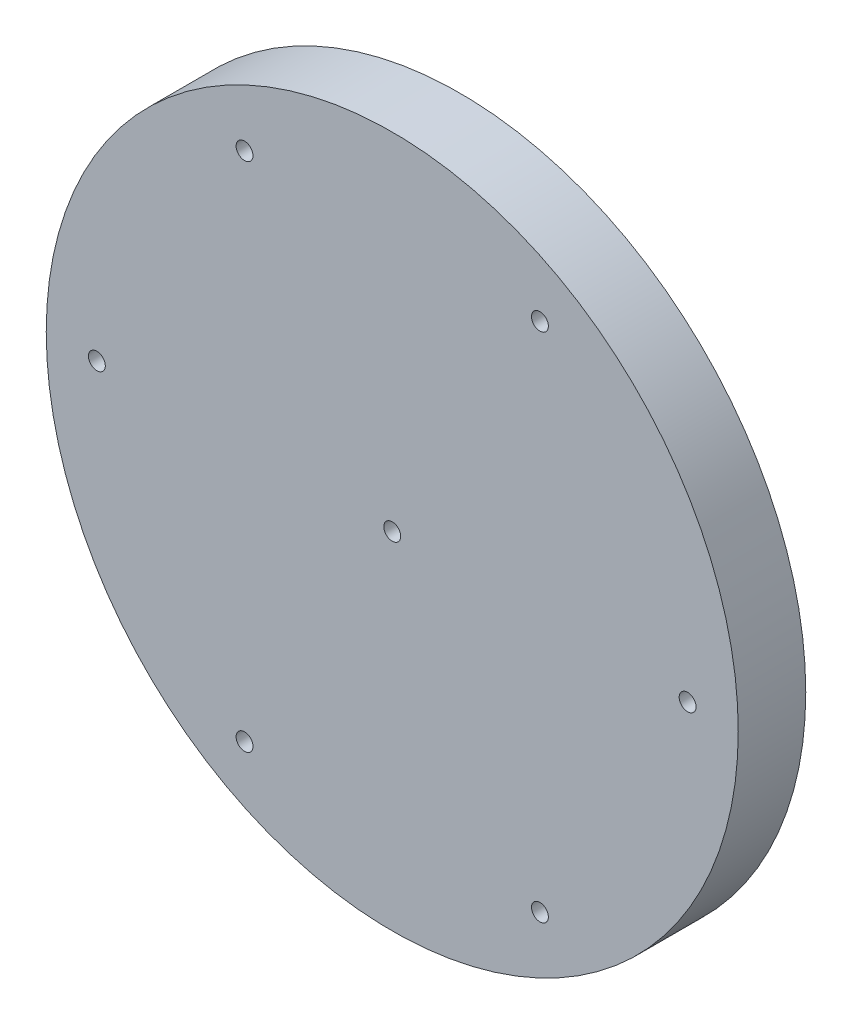
ISO-10303-21;
HEADER;
FILE_DESCRIPTION(('STEP AP214'),'2;1');
FILE_NAME('part.step','',(''),(''),'','','');
FILE_SCHEMA(('AUTOMOTIVE_DESIGN { 1 0 10303 214 1 1 1 1 }'));
ENDSEC;
DATA;
#1=APPLICATION_CONTEXT('core data for automotive mechanical design processes');
#2=APPLICATION_PROTOCOL_DEFINITION('international standard','automotive_design',2000,#1);
#3=PRODUCT_CONTEXT('',#1,'mechanical');
#4=PRODUCT('Part','Part','',(#3));
#5=PRODUCT_RELATED_PRODUCT_CATEGORY('part','',(#4));
#6=PRODUCT_DEFINITION_FORMATION('','',#4);
#7=PRODUCT_DEFINITION_CONTEXT('part definition',#1,'design');
#8=PRODUCT_DEFINITION('design','',#6,#7);
#9=PRODUCT_DEFINITION_SHAPE('','',#8);
#10=(LENGTH_UNIT() NAMED_UNIT(*) SI_UNIT(.MILLI.,.METRE.));
#11=(NAMED_UNIT(*) PLANE_ANGLE_UNIT() SI_UNIT($,.RADIAN.));
#12=(NAMED_UNIT(*) SI_UNIT($,.STERADIAN.) SOLID_ANGLE_UNIT());
#13=UNCERTAINTY_MEASURE_WITH_UNIT(LENGTH_MEASURE(1.E-05),#10,'distance_accuracy_value','');
#14=(GEOMETRIC_REPRESENTATION_CONTEXT(3) GLOBAL_UNCERTAINTY_ASSIGNED_CONTEXT((#13)) GLOBAL_UNIT_ASSIGNED_CONTEXT((#10,
#11,#12)) REPRESENTATION_CONTEXT('',''));
#15=CARTESIAN_POINT('',(0.,0.,0.));
#16=DIRECTION('',(0.,0.,1.));
#17=DIRECTION('',(1.,0.,0.));
#18=AXIS2_PLACEMENT_3D('',#15,#16,#17);
#19=CARTESIAN_POINT('',(0.,0.,4.));
#20=DIRECTION('',(0.,0.,1.));
#21=DIRECTION('',(1.,0.,0.));
#22=AXIS2_PLACEMENT_3D('',#19,#20,#21);
#23=PLANE('',#22);
#24=CARTESIAN_POINT('',(-8.75000000000137,-15.1554445662283,4.));
#25=DIRECTION('',(0.,0.,1.));
#26=DIRECTION('',(1.,0.,0.));
#27=AXIS2_PLACEMENT_3D('',#24,#25,#26);
#28=CIRCLE('',#27,0.500000000000168);
#29=CARTESIAN_POINT('',(-8.2500000000012,-15.1554445662283,4.));
#30=VERTEX_POINT('',#29);
#31=EDGE_CURVE('E72',#30,#30,#28,.T.);
#32=ORIENTED_EDGE('',*,*,#31,.F.);
#33=EDGE_LOOP('',(#32));
#34=FACE_BOUND('',#33,.T.);
#35=CARTESIAN_POINT('',(-8.75000000000137,15.1554445662268,4.));
#36=DIRECTION('',(0.,0.,1.));
#37=DIRECTION('',(1.,0.,0.));
#38=AXIS2_PLACEMENT_3D('',#35,#36,#37);
#39=CIRCLE('',#38,0.500000000002291);
#40=CARTESIAN_POINT('',(-8.24999999999908,15.1554445662268,4.));
#41=VERTEX_POINT('',#40);
#42=EDGE_CURVE('E60',#41,#41,#39,.T.);
#43=ORIENTED_EDGE('',*,*,#42,.F.);
#44=EDGE_LOOP('',(#43));
#45=FACE_BOUND('',#44,.T.);
#46=CARTESIAN_POINT('',(17.5000000000005,0.,4.));
#47=DIRECTION('',(0.,0.,1.));
#48=DIRECTION('',(1.,0.,0.));
#49=AXIS2_PLACEMENT_3D('',#46,#47,#48);
#50=CIRCLE('',#49,0.499999999999776);
#51=CARTESIAN_POINT('',(18.0000000000003,0.,4.));
#52=VERTEX_POINT('',#51);
#53=EDGE_CURVE('E48',#52,#52,#50,.T.);
#54=ORIENTED_EDGE('',*,*,#53,.F.);
#55=EDGE_LOOP('',(#54));
#56=FACE_BOUND('',#55,.T.);
#57=CARTESIAN_POINT('',(0.,0.,4.));
#58=DIRECTION('',(0.,0.,1.));
#59=DIRECTION('',(1.,0.,0.));
#60=AXIS2_PLACEMENT_3D('',#57,#58,#59);
#61=CIRCLE('',#60,20.5000000000002);
#62=CARTESIAN_POINT('',(20.5000000000002,0.,4.));
#63=VERTEX_POINT('',#62);
#64=EDGE_CURVE('E10',#63,#63,#61,.T.);
#65=ORIENTED_EDGE('',*,*,#64,.T.);
#66=EDGE_LOOP('',(#65));
#67=FACE_BOUND('',#66,.T.);
#68=CARTESIAN_POINT('',(0.,0.,4.));
#69=DIRECTION('',(0.,0.,1.));
#70=DIRECTION('',(1.,0.,0.));
#71=AXIS2_PLACEMENT_3D('',#68,#69,#70);
#72=CIRCLE('',#71,0.500000000000167);
#73=CARTESIAN_POINT('',(0.500000000000167,0.,4.));
#74=VERTEX_POINT('',#73);
#75=EDGE_CURVE('E43',#74,#74,#72,.T.);
#76=ORIENTED_EDGE('',*,*,#75,.F.);
#77=EDGE_LOOP('',(#76));
#78=FACE_BOUND('',#77,.T.);
#79=CARTESIAN_POINT('',(8.75000000000048,15.1554445662268,4.));
#80=DIRECTION('',(0.,0.,1.));
#81=DIRECTION('',(1.,0.,0.));
#82=AXIS2_PLACEMENT_3D('',#79,#80,#81);
#83=CIRCLE('',#82,0.499999999999973);
#84=CARTESIAN_POINT('',(9.25000000000045,15.1554445662268,4.));
#85=VERTEX_POINT('',#84);
#86=EDGE_CURVE('E54',#85,#85,#83,.T.);
#87=ORIENTED_EDGE('',*,*,#86,.F.);
#88=EDGE_LOOP('',(#87));
#89=FACE_BOUND('',#88,.T.);
#90=CARTESIAN_POINT('',(-17.5000000000001,0.,4.));
#91=DIRECTION('',(0.,0.,1.));
#92=DIRECTION('',(1.,0.,0.));
#93=AXIS2_PLACEMENT_3D('',#90,#91,#92);
#94=CIRCLE('',#93,0.499999999999776);
#95=CARTESIAN_POINT('',(-17.0000000000003,0.,4.));
#96=VERTEX_POINT('',#95);
#97=EDGE_CURVE('E66',#96,#96,#94,.T.);
#98=ORIENTED_EDGE('',*,*,#97,.F.);
#99=EDGE_LOOP('',(#98));
#100=FACE_BOUND('',#99,.T.);
#101=CARTESIAN_POINT('',(8.75000000000048,-15.1554445662283,4.));
#102=DIRECTION('',(0.,0.,1.));
#103=DIRECTION('',(1.,0.,0.));
#104=AXIS2_PLACEMENT_3D('',#101,#102,#103);
#105=CIRCLE('',#104,0.499999999999973);
#106=CARTESIAN_POINT('',(9.25000000000045,-15.1554445662283,4.));
#107=VERTEX_POINT('',#106);
#108=EDGE_CURVE('E78',#107,#107,#105,.T.);
#109=ORIENTED_EDGE('',*,*,#108,.F.);
#110=EDGE_LOOP('',(#109));
#111=FACE_BOUND('',#110,.T.);
#112=ADVANCED_FACE('F32',(#34,#45,#56,#67,#78,#89,#100,#111),#23,.T.);
#113=CARTESIAN_POINT('',(0.,0.,0.));
#114=DIRECTION('',(0.,0.,1.));
#115=DIRECTION('',(1.,0.,0.));
#116=AXIS2_PLACEMENT_3D('',#113,#114,#115);
#117=PLANE('',#116);
#118=CARTESIAN_POINT('',(-8.75000000000137,-15.1554445662283,0.));
#119=DIRECTION('',(0.,0.,1.));
#120=DIRECTION('',(1.,0.,0.));
#121=AXIS2_PLACEMENT_3D('',#118,#119,#120);
#122=CIRCLE('',#121,0.500000000000168);
#123=CARTESIAN_POINT('',(-8.2500000000012,-15.1554445662283,0.));
#124=VERTEX_POINT('',#123);
#125=EDGE_CURVE('E75',#124,#124,#122,.T.);
#126=ORIENTED_EDGE('',*,*,#125,.T.);
#127=EDGE_LOOP('',(#126));
#128=FACE_BOUND('',#127,.T.);
#129=CARTESIAN_POINT('',(-8.75000000000137,15.1554445662268,0.));
#130=DIRECTION('',(0.,0.,1.));
#131=DIRECTION('',(1.,0.,0.));
#132=AXIS2_PLACEMENT_3D('',#129,#130,#131);
#133=CIRCLE('',#132,0.500000000002291);
#134=CARTESIAN_POINT('',(-8.24999999999908,15.1554445662268,0.));
#135=VERTEX_POINT('',#134);
#136=EDGE_CURVE('E63',#135,#135,#133,.T.);
#137=ORIENTED_EDGE('',*,*,#136,.T.);
#138=EDGE_LOOP('',(#137));
#139=FACE_BOUND('',#138,.T.);
#140=CARTESIAN_POINT('',(17.5000000000005,0.,0.));
#141=DIRECTION('',(0.,0.,1.));
#142=DIRECTION('',(1.,0.,0.));
#143=AXIS2_PLACEMENT_3D('',#140,#141,#142);
#144=CIRCLE('',#143,0.499999999999776);
#145=CARTESIAN_POINT('',(18.0000000000003,0.,0.));
#146=VERTEX_POINT('',#145);
#147=EDGE_CURVE('E51',#146,#146,#144,.T.);
#148=ORIENTED_EDGE('',*,*,#147,.T.);
#149=EDGE_LOOP('',(#148));
#150=FACE_BOUND('',#149,.T.);
#151=CARTESIAN_POINT('',(0.,0.,0.));
#152=DIRECTION('',(0.,0.,1.));
#153=DIRECTION('',(1.,0.,0.));
#154=AXIS2_PLACEMENT_3D('',#151,#152,#153);
#155=CIRCLE('',#154,20.5000000000002);
#156=CARTESIAN_POINT('',(20.5000000000002,0.,0.));
#157=VERTEX_POINT('',#156);
#158=EDGE_CURVE('E36',#157,#157,#155,.T.);
#159=ORIENTED_EDGE('',*,*,#158,.F.);
#160=EDGE_LOOP('',(#159));
#161=FACE_BOUND('',#160,.T.);
#162=CARTESIAN_POINT('',(0.,0.,0.));
#163=DIRECTION('',(0.,0.,1.));
#164=DIRECTION('',(1.,0.,0.));
#165=AXIS2_PLACEMENT_3D('',#162,#163,#164);
#166=CIRCLE('',#165,0.500000000000167);
#167=CARTESIAN_POINT('',(0.500000000000167,0.,0.));
#168=VERTEX_POINT('',#167);
#169=EDGE_CURVE('E45',#168,#168,#166,.T.);
#170=ORIENTED_EDGE('',*,*,#169,.T.);
#171=EDGE_LOOP('',(#170));
#172=FACE_BOUND('',#171,.T.);
#173=CARTESIAN_POINT('',(8.75000000000048,15.1554445662268,0.));
#174=DIRECTION('',(0.,0.,1.));
#175=DIRECTION('',(1.,0.,0.));
#176=AXIS2_PLACEMENT_3D('',#173,#174,#175);
#177=CIRCLE('',#176,0.499999999999973);
#178=CARTESIAN_POINT('',(9.25000000000045,15.1554445662268,0.));
#179=VERTEX_POINT('',#178);
#180=EDGE_CURVE('E57',#179,#179,#177,.T.);
#181=ORIENTED_EDGE('',*,*,#180,.T.);
#182=EDGE_LOOP('',(#181));
#183=FACE_BOUND('',#182,.T.);
#184=CARTESIAN_POINT('',(-17.5000000000001,0.,0.));
#185=DIRECTION('',(0.,0.,1.));
#186=DIRECTION('',(1.,0.,0.));
#187=AXIS2_PLACEMENT_3D('',#184,#185,#186);
#188=CIRCLE('',#187,0.499999999999776);
#189=CARTESIAN_POINT('',(-17.0000000000003,0.,0.));
#190=VERTEX_POINT('',#189);
#191=EDGE_CURVE('E69',#190,#190,#188,.T.);
#192=ORIENTED_EDGE('',*,*,#191,.T.);
#193=EDGE_LOOP('',(#192));
#194=FACE_BOUND('',#193,.T.);
#195=CARTESIAN_POINT('',(8.75000000000048,-15.1554445662283,0.));
#196=DIRECTION('',(0.,0.,1.));
#197=DIRECTION('',(1.,0.,0.));
#198=AXIS2_PLACEMENT_3D('',#195,#196,#197);
#199=CIRCLE('',#198,0.499999999999973);
#200=CARTESIAN_POINT('',(9.25000000000045,-15.1554445662283,0.));
#201=VERTEX_POINT('',#200);
#202=EDGE_CURVE('E81',#201,#201,#199,.T.);
#203=ORIENTED_EDGE('',*,*,#202,.T.);
#204=EDGE_LOOP('',(#203));
#205=FACE_BOUND('',#204,.T.);
#206=ADVANCED_FACE('F91',(#128,#139,#150,#161,#172,#183,#194,#205),#117,.F.);
#207=CARTESIAN_POINT('',(0.,0.,4.));
#208=DIRECTION('',(0.,0.,-1.));
#209=DIRECTION('',(-1.,0.,0.));
#210=AXIS2_PLACEMENT_3D('',#207,#208,#209);
#211=CYLINDRICAL_SURFACE('',#210,20.5000000000002);
#212=ORIENTED_EDGE('',*,*,#64,.F.);
#213=EDGE_LOOP('',(#212));
#214=FACE_BOUND('',#213,.T.);
#215=ORIENTED_EDGE('',*,*,#158,.T.);
#216=EDGE_LOOP('',(#215));
#217=FACE_BOUND('',#216,.T.);
#218=ADVANCED_FACE('F34',(#214,#217),#211,.T.);
#219=CARTESIAN_POINT('',(0.,0.,4.));
#220=DIRECTION('',(0.,0.,-1.));
#221=DIRECTION('',(-1.,0.,0.));
#222=AXIS2_PLACEMENT_3D('',#219,#220,#221);
#223=CYLINDRICAL_SURFACE('',#222,0.500000000000167);
#224=ORIENTED_EDGE('',*,*,#75,.T.);
#225=EDGE_LOOP('',(#224));
#226=FACE_BOUND('',#225,.T.);
#227=ORIENTED_EDGE('',*,*,#169,.F.);
#228=EDGE_LOOP('',(#227));
#229=FACE_BOUND('',#228,.T.);
#230=ADVANCED_FACE('F101',(#226,#229),#223,.F.);
#231=CARTESIAN_POINT('',(17.5000000000005,0.,4.));
#232=DIRECTION('',(0.,0.,-1.));
#233=DIRECTION('',(-1.,0.,0.));
#234=AXIS2_PLACEMENT_3D('',#231,#232,#233);
#235=CYLINDRICAL_SURFACE('',#234,0.499999999999776);
#236=ORIENTED_EDGE('',*,*,#53,.T.);
#237=EDGE_LOOP('',(#236));
#238=FACE_BOUND('',#237,.T.);
#239=ORIENTED_EDGE('',*,*,#147,.F.);
#240=EDGE_LOOP('',(#239));
#241=FACE_BOUND('',#240,.T.);
#242=ADVANCED_FACE('F104',(#238,#241),#235,.F.);
#243=CARTESIAN_POINT('',(8.75000000000048,15.1554445662268,4.));
#244=DIRECTION('',(0.,0.,-1.));
#245=DIRECTION('',(-1.,0.,0.));
#246=AXIS2_PLACEMENT_3D('',#243,#244,#245);
#247=CYLINDRICAL_SURFACE('',#246,0.499999999999973);
#248=ORIENTED_EDGE('',*,*,#86,.T.);
#249=EDGE_LOOP('',(#248));
#250=FACE_BOUND('',#249,.T.);
#251=ORIENTED_EDGE('',*,*,#180,.F.);
#252=EDGE_LOOP('',(#251));
#253=FACE_BOUND('',#252,.T.);
#254=ADVANCED_FACE('F108',(#250,#253),#247,.F.);
#255=CARTESIAN_POINT('',(-8.75000000000137,15.1554445662268,4.));
#256=DIRECTION('',(0.,0.,-1.));
#257=DIRECTION('',(-1.,0.,0.));
#258=AXIS2_PLACEMENT_3D('',#255,#256,#257);
#259=CYLINDRICAL_SURFACE('',#258,0.500000000002291);
#260=ORIENTED_EDGE('',*,*,#42,.T.);
#261=EDGE_LOOP('',(#260));
#262=FACE_BOUND('',#261,.T.);
#263=ORIENTED_EDGE('',*,*,#136,.F.);
#264=EDGE_LOOP('',(#263));
#265=FACE_BOUND('',#264,.T.);
#266=ADVANCED_FACE('F112',(#262,#265),#259,.F.);
#267=CARTESIAN_POINT('',(-17.5000000000001,0.,4.));
#268=DIRECTION('',(0.,0.,-1.));
#269=DIRECTION('',(-1.,0.,0.));
#270=AXIS2_PLACEMENT_3D('',#267,#268,#269);
#271=CYLINDRICAL_SURFACE('',#270,0.499999999999776);
#272=ORIENTED_EDGE('',*,*,#97,.T.);
#273=EDGE_LOOP('',(#272));
#274=FACE_BOUND('',#273,.T.);
#275=ORIENTED_EDGE('',*,*,#191,.F.);
#276=EDGE_LOOP('',(#275));
#277=FACE_BOUND('',#276,.T.);
#278=ADVANCED_FACE('F116',(#274,#277),#271,.F.);
#279=CARTESIAN_POINT('',(-8.75000000000137,-15.1554445662283,4.));
#280=DIRECTION('',(0.,0.,-1.));
#281=DIRECTION('',(-1.,0.,0.));
#282=AXIS2_PLACEMENT_3D('',#279,#280,#281);
#283=CYLINDRICAL_SURFACE('',#282,0.500000000000168);
#284=ORIENTED_EDGE('',*,*,#31,.T.);
#285=EDGE_LOOP('',(#284));
#286=FACE_BOUND('',#285,.T.);
#287=ORIENTED_EDGE('',*,*,#125,.F.);
#288=EDGE_LOOP('',(#287));
#289=FACE_BOUND('',#288,.T.);
#290=ADVANCED_FACE('F120',(#286,#289),#283,.F.);
#291=CARTESIAN_POINT('',(8.75000000000048,-15.1554445662283,4.));
#292=DIRECTION('',(0.,0.,-1.));
#293=DIRECTION('',(-1.,0.,0.));
#294=AXIS2_PLACEMENT_3D('',#291,#292,#293);
#295=CYLINDRICAL_SURFACE('',#294,0.499999999999973);
#296=ORIENTED_EDGE('',*,*,#108,.T.);
#297=EDGE_LOOP('',(#296));
#298=FACE_BOUND('',#297,.T.);
#299=ORIENTED_EDGE('',*,*,#202,.F.);
#300=EDGE_LOOP('',(#299));
#301=FACE_BOUND('',#300,.T.);
#302=ADVANCED_FACE('F87',(#298,#301),#295,.F.);
#303=CLOSED_SHELL('',(#112,#206,#218,#230,#242,#254,#266,#278,#290,#302));
#304=MANIFOLD_SOLID_BREP('B2',#303);
#305=ADVANCED_BREP_SHAPE_REPRESENTATION('',(#18,#304),#14);
#306=SHAPE_DEFINITION_REPRESENTATION(#9,#305);
ENDSEC;
END-ISO-10303-21;
